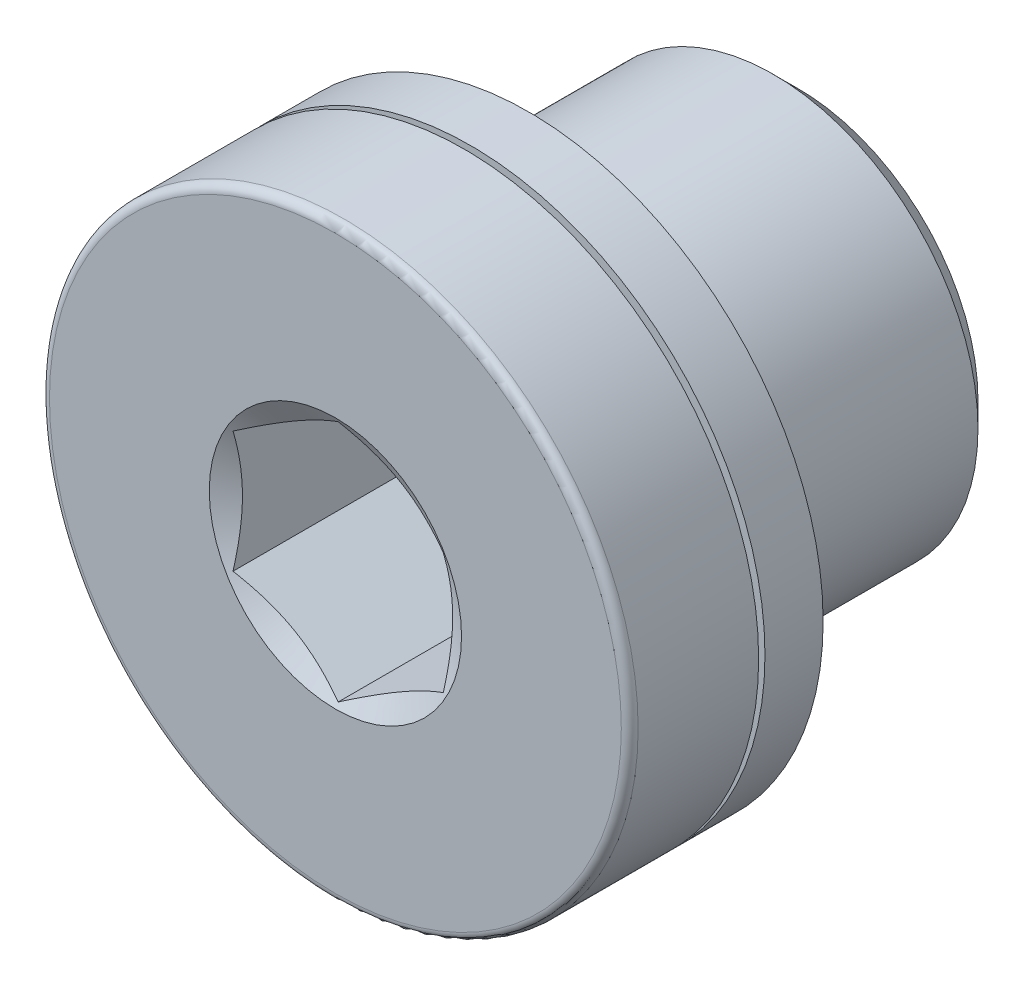
ISO-10303-21;
HEADER;
FILE_DESCRIPTION(('STEP AP214'),'2;1');
FILE_NAME('part.step','',(''),(''),'','','');
FILE_SCHEMA(('AUTOMOTIVE_DESIGN { 1 0 10303 214 1 1 1 1 }'));
ENDSEC;
DATA;
#1=APPLICATION_CONTEXT('core data for automotive mechanical design processes');
#2=APPLICATION_PROTOCOL_DEFINITION('international standard','automotive_design',2000,#1);
#3=PRODUCT_CONTEXT('',#1,'mechanical');
#4=PRODUCT('Part','Part','',(#3));
#5=PRODUCT_RELATED_PRODUCT_CATEGORY('part','',(#4));
#6=PRODUCT_DEFINITION_FORMATION('','',#4);
#7=PRODUCT_DEFINITION_CONTEXT('part definition',#1,'design');
#8=PRODUCT_DEFINITION('design','',#6,#7);
#9=PRODUCT_DEFINITION_SHAPE('','',#8);
#10=(LENGTH_UNIT() NAMED_UNIT(*) SI_UNIT(.MILLI.,.METRE.));
#11=(NAMED_UNIT(*) PLANE_ANGLE_UNIT() SI_UNIT($,.RADIAN.));
#12=(NAMED_UNIT(*) SI_UNIT($,.STERADIAN.) SOLID_ANGLE_UNIT());
#13=UNCERTAINTY_MEASURE_WITH_UNIT(LENGTH_MEASURE(1.E-05),#10,'distance_accuracy_value','');
#14=(GEOMETRIC_REPRESENTATION_CONTEXT(3) GLOBAL_UNCERTAINTY_ASSIGNED_CONTEXT((#13)) GLOBAL_UNIT_ASSIGNED_CONTEXT((#10,
#11,#12)) REPRESENTATION_CONTEXT('',''));
#15=CARTESIAN_POINT('',(0.,0.,0.));
#16=DIRECTION('',(0.,0.,1.));
#17=DIRECTION('',(1.,0.,0.));
#18=AXIS2_PLACEMENT_3D('',#15,#16,#17);
#19=CARTESIAN_POINT('',(0.,0.,4.6));
#20=DIRECTION('',(0.,0.,1.));
#21=DIRECTION('',(1.,0.,0.));
#22=AXIS2_PLACEMENT_3D('',#19,#20,#21);
#23=CONICAL_SURFACE('',#22,3.,1.04719755119659);
#24=CARTESIAN_POINT('',(0.0002,-2.88686681600194,4.53468252976428));
#25=CARTESIAN_POINT('',(-0.109663234734872,-2.82343724785372,4.4980464855128));
#26=CARTESIAN_POINT('',(-0.220474799896527,-2.75946016087832,4.46472708437023));
#27=CARTESIAN_POINT('',(-0.444016833466053,-2.63039810762176,4.40656715096303));
#28=CARTESIAN_POINT('',(-0.556751274528392,-2.56531084772748,4.38174719455291));
#29=CARTESIAN_POINT('',(-0.780822993875274,-2.43594298024478,4.34311051684623));
#30=CARTESIAN_POINT('',(-0.892125791767382,-2.37168227992022,4.32903666159082));
#31=CARTESIAN_POINT('',(-1.11525522746834,-2.24285844015414,4.31223401775793));
#32=CARTESIAN_POINT('',(-1.22708105401423,-2.17829576909552,4.30949131660881));
#33=CARTESIAN_POINT('',(-1.43604197555153,-2.05765212479586,4.31519062541324));
#34=CARTESIAN_POINT('',(-1.53320831755774,-2.00155311108241,4.32223325978705));
#35=CARTESIAN_POINT('',(-1.72690794971101,-1.88972057631679,4.34455628453013));
#36=CARTESIAN_POINT('',(-1.82344056965974,-1.83398744220381,4.35984430384546));
#37=CARTESIAN_POINT('',(-2.01753972174048,-1.72192424450052,4.39806395924961));
#38=CARTESIAN_POINT('',(-2.11508168178214,-1.66560836761319,4.42115764153071));
#39=CARTESIAN_POINT('',(-2.30871060807609,-1.55381665489449,4.47357152198311));
#40=CARTESIAN_POINT('',(-2.40480005588618,-1.49833938633505,4.50287940102974));
#41=CARTESIAN_POINT('',(-2.5002,-1.44326020292026,4.5346825297643));
#42=B_SPLINE_CURVE_WITH_KNOTS('',3,(#24,#25,#26,#27,#28,#29,#30,#31,#32,#33,#34,#35,#36,#37,#38,
#39,#40,#41),.UNSPECIFIED.,.F.,.F.,(4,2,2,2,2,2,2,2,4),(0.,0.396285827362224,0.793524330152046,
1.18093086852113,1.56786160134474,1.90479741793731,2.24204551660461,2.58677531536753,
2.93082800105253),.UNSPECIFIED.);
#43=CARTESIAN_POINT('',(0.,-2.8867513459481,4.53461585909777));
#44=VERTEX_POINT('',#43);
#45=CARTESIAN_POINT('',(-2.5,-1.4433756729741,4.5346158590978));
#46=VERTEX_POINT('',#45);
#47=EDGE_CURVE('E169',#44,#46,#42,.T.);
#48=ORIENTED_EDGE('',*,*,#47,.T.);
#49=CARTESIAN_POINT('',(-2.5,-3.75749145788339,5.47363157625222));
#50=CARTESIAN_POINT('',(-2.5,-3.64919841186996,5.42159269845017));
#51=CARTESIAN_POINT('',(-2.5,-3.54064339466357,5.37008890891806));
#52=CARTESIAN_POINT('',(-2.5,-3.3228694949907,5.26845533167727));
#53=CARTESIAN_POINT('',(-2.5,-3.21365049870229,5.21832578815435));
#54=CARTESIAN_POINT('',(-2.5,-2.99378661171534,5.11946624529765));
#55=CARTESIAN_POINT('',(-2.5,-2.88313709481265,5.07074649627705));
#56=CARTESIAN_POINT('',(-2.5,-2.66091438011002,4.97546923020821));
#57=CARTESIAN_POINT('',(-2.5,-2.54934123033597,4.9289116015586));
#58=CARTESIAN_POINT('',(-2.5,-2.32208129336724,4.83731979627917));
#59=CARTESIAN_POINT('',(-2.5,-2.20636439775533,4.79235988936502));
#60=CARTESIAN_POINT('',(-2.5,-1.97353370620353,4.70614167940336));
#61=CARTESIAN_POINT('',(-2.5,-1.85641974950128,4.66488380710281));
#62=CARTESIAN_POINT('',(-2.5,-1.62086916254349,4.5872406855576));
#63=CARTESIAN_POINT('',(-2.5,-1.50243619221283,4.55084445195485));
#64=CARTESIAN_POINT('',(-2.5,-1.26387801933199,4.48416968869073));
#65=CARTESIAN_POINT('',(-2.5,-1.14375340016755,4.45388910268924));
#66=CARTESIAN_POINT('',(-2.5,-0.902338315588339,4.40111657414383));
#67=CARTESIAN_POINT('',(-2.5,-0.781055515817549,4.37859024001396));
#68=CARTESIAN_POINT('',(-2.5,-0.537116621073338,4.3426935344368));
#69=CARTESIAN_POINT('',(-2.5,-0.414460624499676,4.32932251115766));
#70=CARTESIAN_POINT('',(-2.5,-0.169933632509077,4.31297766586888));
#71=CARTESIAN_POINT('',(-2.5,-0.0480711310514733,4.30987983675657));
#72=CARTESIAN_POINT('',(-2.5,0.195485912370085,4.31402426820572));
#73=CARTESIAN_POINT('',(-2.5,0.317180443894922,4.32126714481277));
#74=CARTESIAN_POINT('',(-2.5,0.527456408460873,4.34222611926243));
#75=CARTESIAN_POINT('',(-2.5,0.616270494320809,4.35371939209446));
#76=CARTESIAN_POINT('',(-2.5,0.793165661114637,4.38142947009885));
#77=CARTESIAN_POINT('',(-2.5,0.881246624045095,4.39764702112567));
#78=CARTESIAN_POINT('',(-2.5,1.14430390620604,4.45252703656414));
#79=CARTESIAN_POINT('',(-2.5,1.31798441198842,4.49740451996552));
#80=CARTESIAN_POINT('',(-2.5,1.66560393932168,4.60012958744614));
#81=CARTESIAN_POINT('',(-2.5,1.83945995346305,4.65824757701734));
#82=CARTESIAN_POINT('',(-2.5,2.09786165668661,4.75179017857617));
#83=CARTESIAN_POINT('',(-2.5,2.1835867516938,4.78402705771562));
#84=CARTESIAN_POINT('',(-2.5,2.35434488597652,4.85028226615287));
#85=CARTESIAN_POINT('',(-2.5,2.43937793702382,4.88430056507499));
#86=CARTESIAN_POINT('',(-2.5,2.65783078845747,4.97390856047049));
#87=CARTESIAN_POINT('',(-2.5,2.79079865565841,5.03059753836762));
#88=CARTESIAN_POINT('',(-2.5,3.05552029816646,5.14675125941288));
#89=CARTESIAN_POINT('',(-2.5,3.1872739810192,5.20621621188097));
#90=CARTESIAN_POINT('',(-2.5,3.44982928957636,5.32729059884971));
#91=CARTESIAN_POINT('',(-2.5,3.58063066968332,5.38890056440082));
#92=CARTESIAN_POINT('',(-2.5,3.84143730899347,5.5137857678841));
#93=CARTESIAN_POINT('',(-2.5,3.97144255002224,5.5770610436589));
#94=CARTESIAN_POINT('',(-2.5,4.36080606086041,5.76899660590649));
#95=CARTESIAN_POINT('',(-2.5,4.61919627366509,5.89961875475503));
#96=CARTESIAN_POINT('',(-2.5,5.13419069594109,6.16422182703926));
#97=CARTESIAN_POINT('',(-2.5,5.39079516582663,6.29820224704552));
#98=CARTESIAN_POINT('',(-2.5,5.87829290022415,6.55556666858143));
#99=CARTESIAN_POINT('',(-2.5,6.1092982352758,6.67873872928103));
#100=CARTESIAN_POINT('',(-2.5,6.57056638334677,6.92648759696893));
#101=CARTESIAN_POINT('',(-2.5,6.80082916311344,7.05106446577326));
#102=CARTESIAN_POINT('',(-2.5,7.26018235402638,7.30094373247041));
#103=CARTESIAN_POINT('',(-2.5,7.48927425655952,7.42624339179654));
#104=CARTESIAN_POINT('',(-2.5,7.94699348534722,7.67765659040072));
#105=CARTESIAN_POINT('',(-2.5,8.17562083840484,7.80377008086275));
#106=CARTESIAN_POINT('',(-2.5,8.40408211674829,7.9301817771395));
#107=B_SPLINE_CURVE_WITH_KNOTS('',3,(#49,#50,#51,#52,#53,#54,#55,#56,#57,#58,#59,#60,#61,#62,
#63,#64,#65,#66,#67,#68,#69,#70,#71,#72,#73,#74,#75,#76,#77,#78,#79,#80,#81,#82,#83,#84,#85,#86,
#87,#88,#89,#90,#91,#92,#93,#94,#95,#96,#97,#98,#99,#100,#101,#102,#103,#104,#105,#106),
.UNSPECIFIED.,.F.,.F.,(4,2,2,2,2,2,2,2,2,2,2,2,2,2,2,2,2,2,2,2,2,2,2,2,2,2,2,2,4),(0.,
0.360447630530675,0.720958898184671,1.08364194495586,1.44630625039165,1.81869010813538,
2.19111723824031,2.56268813752938,2.9341338901541,3.30391031762943,3.6736604153465,
4.03893071469015,4.40422277585142,4.67275529434614,4.94133023092329,5.47881127867105,
6.02844936287521,6.30319201919184,6.57792999229022,7.01152864941954,7.44516005465796,
7.87889959021416,8.31264899062128,9.18119380548513,10.0496091887469,10.8349772920855,
11.6203800900341,12.4037350961383,13.1870435431149),.UNSPECIFIED.);
#108=CARTESIAN_POINT('',(-2.5,1.4433756729741,4.5346158590978));
#109=VERTEX_POINT('',#108);
#110=EDGE_CURVE('E11',#46,#109,#107,.T.);
#111=ORIENTED_EDGE('',*,*,#110,.T.);
#112=CARTESIAN_POINT('',(-2.5002,1.44326020292026,4.5346825297643));
#113=CARTESIAN_POINT('',(-2.39033676526513,1.50668977106848,4.49804648551282));
#114=CARTESIAN_POINT('',(-2.27952520010347,1.57066685804388,4.46472708437025));
#115=CARTESIAN_POINT('',(-2.05598316653394,1.69972891130044,4.40656715096305));
#116=CARTESIAN_POINT('',(-1.9432487254716,1.76481617119472,4.38174719455293));
#117=CARTESIAN_POINT('',(-1.71917700612472,1.89418403867742,4.34311051684624));
#118=CARTESIAN_POINT('',(-1.60787420823261,1.95844473900199,4.32903666159083));
#119=CARTESIAN_POINT('',(-1.38474477253165,2.08726857876806,4.31223401775793));
#120=CARTESIAN_POINT('',(-1.27291894598575,2.15183124982668,4.30949131660881));
#121=CARTESIAN_POINT('',(-1.06395802444846,2.27247489412635,4.31519062541324));
#122=CARTESIAN_POINT('',(-0.966791682442249,2.3285739078398,4.32223325978704));
#123=CARTESIAN_POINT('',(-0.773092050288982,2.44040644260542,4.34455628453012));
#124=CARTESIAN_POINT('',(-0.676559430340254,2.49613957671839,4.35984430384545));
#125=CARTESIAN_POINT('',(-0.482460278259514,2.60820277442168,4.3980639592496));
#126=CARTESIAN_POINT('',(-0.384918318217852,2.66451865130901,4.42115764153069));
#127=CARTESIAN_POINT('',(-0.191289391923912,2.77631036402771,4.47357152198309));
#128=CARTESIAN_POINT('',(-0.0951999441138225,2.83178763258715,4.50287940102972));
#129=CARTESIAN_POINT('',(0.000199999999999802,2.88686681600194,4.53468252976428));
#130=B_SPLINE_CURVE_WITH_KNOTS('',3,(#112,#113,#114,#115,#116,#117,#118,#119,#120,#121,#122,
#123,#124,#125,#126,#127,#128,#129),.UNSPECIFIED.,.F.,.F.,(4,2,2,2,2,2,2,2,4),(0.,
0.39628582736223,0.793524330152058,1.18093086852115,1.56786160134477,1.90479741793733,
2.24204551660462,2.58677531536754,2.93082800105253),.UNSPECIFIED.);
#131=CARTESIAN_POINT('',(0.,2.8867513459481,4.53461585909777));
#132=VERTEX_POINT('',#131);
#133=EDGE_CURVE('E49',#109,#132,#130,.T.);
#134=ORIENTED_EDGE('',*,*,#133,.T.);
#135=CARTESIAN_POINT('',(-0.0002,2.88686681600194,4.53468252976428));
#136=CARTESIAN_POINT('',(0.109663234734872,2.82343724785372,4.4980464855128));
#137=CARTESIAN_POINT('',(0.220474799896527,2.75946016087832,4.46472708437023));
#138=CARTESIAN_POINT('',(0.444016833466053,2.63039810762176,4.40656715096303));
#139=CARTESIAN_POINT('',(0.556751274528392,2.56531084772748,4.38174719455291));
#140=CARTESIAN_POINT('',(0.780822993875274,2.43594298024478,4.34311051684623));
#141=CARTESIAN_POINT('',(0.892125791767382,2.37168227992022,4.32903666159082));
#142=CARTESIAN_POINT('',(1.11525522746834,2.24285844015414,4.31223401775793));
#143=CARTESIAN_POINT('',(1.22708105401423,2.17829576909552,4.30949131660881));
#144=CARTESIAN_POINT('',(1.43604197555153,2.05765212479586,4.31519062541324));
#145=CARTESIAN_POINT('',(1.53320831755774,2.00155311108241,4.32223325978705));
#146=CARTESIAN_POINT('',(1.72690794971101,1.88972057631679,4.34455628453013));
#147=CARTESIAN_POINT('',(1.82344056965974,1.83398744220381,4.35984430384546));
#148=CARTESIAN_POINT('',(2.01753972174048,1.72192424450052,4.39806395924961));
#149=CARTESIAN_POINT('',(2.11508168178214,1.66560836761319,4.42115764153071));
#150=CARTESIAN_POINT('',(2.30871060807609,1.55381665489449,4.47357152198311));
#151=CARTESIAN_POINT('',(2.40480005588618,1.49833938633505,4.50287940102974));
#152=CARTESIAN_POINT('',(2.5002,1.44326020292026,4.5346825297643));
#153=B_SPLINE_CURVE_WITH_KNOTS('',3,(#135,#136,#137,#138,#139,#140,#141,#142,#143,#144,#145,
#146,#147,#148,#149,#150,#151,#152),.UNSPECIFIED.,.F.,.F.,(4,2,2,2,2,2,2,2,4),(0.,
0.396285827362224,0.793524330152046,1.18093086852113,1.56786160134474,1.90479741793731,
2.24204551660461,2.58677531536753,2.93082800105253),.UNSPECIFIED.);
#154=CARTESIAN_POINT('',(2.5,1.4433756729741,4.5346158590978));
#155=VERTEX_POINT('',#154);
#156=EDGE_CURVE('E279',#132,#155,#153,.T.);
#157=ORIENTED_EDGE('',*,*,#156,.T.);
#158=CARTESIAN_POINT('',(2.5,-3.75749145788339,5.47363157625222));
#159=CARTESIAN_POINT('',(2.5,-3.64919841186996,5.42159269845017));
#160=CARTESIAN_POINT('',(2.5,-3.54064339466357,5.37008890891806));
#161=CARTESIAN_POINT('',(2.5,-3.3228694949907,5.26845533167727));
#162=CARTESIAN_POINT('',(2.5,-3.21365049870229,5.21832578815435));
#163=CARTESIAN_POINT('',(2.5,-2.99378661171534,5.11946624529765));
#164=CARTESIAN_POINT('',(2.5,-2.88313709481265,5.07074649627705));
#165=CARTESIAN_POINT('',(2.5,-2.66091438011002,4.97546923020821));
#166=CARTESIAN_POINT('',(2.5,-2.54934123033597,4.9289116015586));
#167=CARTESIAN_POINT('',(2.5,-2.32208129336724,4.83731979627917));
#168=CARTESIAN_POINT('',(2.5,-2.20636439775533,4.79235988936502));
#169=CARTESIAN_POINT('',(2.5,-1.97353370620353,4.70614167940336));
#170=CARTESIAN_POINT('',(2.5,-1.85641974950128,4.66488380710281));
#171=CARTESIAN_POINT('',(2.5,-1.62086916254349,4.5872406855576));
#172=CARTESIAN_POINT('',(2.5,-1.50243619221283,4.55084445195485));
#173=CARTESIAN_POINT('',(2.5,-1.26387801933199,4.48416968869073));
#174=CARTESIAN_POINT('',(2.5,-1.14375340016755,4.45388910268924));
#175=CARTESIAN_POINT('',(2.5,-0.902338315588339,4.40111657414383));
#176=CARTESIAN_POINT('',(2.5,-0.781055515817549,4.37859024001396));
#177=CARTESIAN_POINT('',(2.5,-0.537116621073338,4.3426935344368));
#178=CARTESIAN_POINT('',(2.5,-0.414460624499676,4.32932251115766));
#179=CARTESIAN_POINT('',(2.5,-0.169933632509077,4.31297766586888));
#180=CARTESIAN_POINT('',(2.5,-0.0480711310514733,4.30987983675657));
#181=CARTESIAN_POINT('',(2.5,0.195485912370085,4.31402426820572));
#182=CARTESIAN_POINT('',(2.5,0.317180443894922,4.32126714481277));
#183=CARTESIAN_POINT('',(2.5,0.527456408460873,4.34222611926243));
#184=CARTESIAN_POINT('',(2.5,0.616270494320809,4.35371939209446));
#185=CARTESIAN_POINT('',(2.5,0.793165661114637,4.38142947009885));
#186=CARTESIAN_POINT('',(2.5,0.881246624045095,4.39764702112567));
#187=CARTESIAN_POINT('',(2.5,1.14430390620604,4.45252703656414));
#188=CARTESIAN_POINT('',(2.5,1.31798441198842,4.49740451996552));
#189=CARTESIAN_POINT('',(2.5,1.66560393932168,4.60012958744614));
#190=CARTESIAN_POINT('',(2.5,1.83945995346305,4.65824757701734));
#191=CARTESIAN_POINT('',(2.5,2.09786165668661,4.75179017857617));
#192=CARTESIAN_POINT('',(2.5,2.1835867516938,4.78402705771562));
#193=CARTESIAN_POINT('',(2.5,2.35434488597652,4.85028226615287));
#194=CARTESIAN_POINT('',(2.5,2.43937793702382,4.88430056507499));
#195=CARTESIAN_POINT('',(2.5,2.65783078845747,4.97390856047049));
#196=CARTESIAN_POINT('',(2.5,2.79079865565841,5.03059753836762));
#197=CARTESIAN_POINT('',(2.5,3.05552029816646,5.14675125941288));
#198=CARTESIAN_POINT('',(2.5,3.1872739810192,5.20621621188097));
#199=CARTESIAN_POINT('',(2.5,3.44982928957636,5.32729059884971));
#200=CARTESIAN_POINT('',(2.5,3.58063066968332,5.38890056440082));
#201=CARTESIAN_POINT('',(2.5,3.84143730899347,5.5137857678841));
#202=CARTESIAN_POINT('',(2.5,3.97144255002224,5.5770610436589));
#203=CARTESIAN_POINT('',(2.5,4.36080606086041,5.76899660590649));
#204=CARTESIAN_POINT('',(2.5,4.61919627366509,5.89961875475503));
#205=CARTESIAN_POINT('',(2.5,5.13419069594109,6.16422182703926));
#206=CARTESIAN_POINT('',(2.5,5.39079516582663,6.29820224704552));
#207=CARTESIAN_POINT('',(2.5,5.87829290022415,6.55556666858143));
#208=CARTESIAN_POINT('',(2.5,6.1092982352758,6.67873872928103));
#209=CARTESIAN_POINT('',(2.5,6.57056638334677,6.92648759696893));
#210=CARTESIAN_POINT('',(2.5,6.80082916311344,7.05106446577326));
#211=CARTESIAN_POINT('',(2.5,7.26018235402638,7.30094373247041));
#212=CARTESIAN_POINT('',(2.5,7.48927425655952,7.42624339179654));
#213=CARTESIAN_POINT('',(2.5,7.94699348534722,7.67765659040072));
#214=CARTESIAN_POINT('',(2.5,8.17562083840484,7.80377008086275));
#215=CARTESIAN_POINT('',(2.5,8.40408211674829,7.9301817771395));
#216=B_SPLINE_CURVE_WITH_KNOTS('',3,(#158,#159,#160,#161,#162,#163,#164,#165,#166,#167,#168,
#169,#170,#171,#172,#173,#174,#175,#176,#177,#178,#179,#180,#181,#182,#183,#184,#185,#186,#187,
#188,#189,#190,#191,#192,#193,#194,#195,#196,#197,#198,#199,#200,#201,#202,#203,#204,#205,#206,
#207,#208,#209,#210,#211,#212,#213,#214,#215),.UNSPECIFIED.,.F.,.F.,(4,2,2,2,2,2,2,2,2,2,2,2,2,
2,2,2,2,2,2,2,2,2,2,2,2,2,2,2,4),(0.,0.360447630530675,0.720958898184671,1.08364194495586,
1.44630625039165,1.81869010813538,2.19111723824031,2.56268813752938,2.9341338901541,
3.30391031762943,3.6736604153465,4.03893071469015,4.40422277585142,4.67275529434614,
4.94133023092329,5.47881127867105,6.02844936287521,6.30319201919184,6.57792999229022,
7.01152864941954,7.44516005465796,7.87889959021416,8.31264899062128,9.18119380548513,
10.0496091887469,10.8349772920855,11.6203800900341,12.4037350961383,13.1870435431149),.UNSPECIFIED.);
#217=CARTESIAN_POINT('',(2.5,-1.4433756729741,4.5346158590978));
#218=VERTEX_POINT('',#217);
#219=EDGE_CURVE('E275',#155,#218,#216,.F.);
#220=ORIENTED_EDGE('',*,*,#219,.T.);
#221=CARTESIAN_POINT('',(2.5002,-1.44326020292026,4.5346825297643));
#222=CARTESIAN_POINT('',(2.39033676526513,-1.50668977106848,4.49804648551282));
#223=CARTESIAN_POINT('',(2.27952520010347,-1.57066685804388,4.46472708437025));
#224=CARTESIAN_POINT('',(2.05598316653394,-1.69972891130044,4.40656715096305));
#225=CARTESIAN_POINT('',(1.9432487254716,-1.76481617119472,4.38174719455293));
#226=CARTESIAN_POINT('',(1.71917700612472,-1.89418403867742,4.34311051684624));
#227=CARTESIAN_POINT('',(1.60787420823261,-1.95844473900199,4.32903666159083));
#228=CARTESIAN_POINT('',(1.38474477253165,-2.08726857876806,4.31223401775793));
#229=CARTESIAN_POINT('',(1.27291894598575,-2.15183124982668,4.30949131660881));
#230=CARTESIAN_POINT('',(1.06395802444846,-2.27247489412635,4.31519062541324));
#231=CARTESIAN_POINT('',(0.966791682442249,-2.3285739078398,4.32223325978704));
#232=CARTESIAN_POINT('',(0.773092050288982,-2.44040644260542,4.34455628453012));
#233=CARTESIAN_POINT('',(0.676559430340254,-2.49613957671839,4.35984430384545));
#234=CARTESIAN_POINT('',(0.482460278259514,-2.60820277442168,4.3980639592496));
#235=CARTESIAN_POINT('',(0.384918318217852,-2.66451865130901,4.42115764153069));
#236=CARTESIAN_POINT('',(0.191289391923912,-2.77631036402771,4.47357152198309));
#237=CARTESIAN_POINT('',(0.0951999441138225,-2.83178763258715,4.50287940102972));
#238=CARTESIAN_POINT('',(-0.000199999999999802,-2.88686681600194,4.53468252976428));
#239=B_SPLINE_CURVE_WITH_KNOTS('',3,(#221,#222,#223,#224,#225,#226,#227,#228,#229,#230,#231,
#232,#233,#234,#235,#236,#237,#238),.UNSPECIFIED.,.F.,.F.,(4,2,2,2,2,2,2,2,4),(0.,
0.39628582736223,0.793524330152058,1.18093086852115,1.56786160134477,1.90479741793733,
2.24204551660462,2.58677531536754,2.93082800105253),.UNSPECIFIED.);
#240=EDGE_CURVE('E176',#218,#44,#239,.T.);
#241=ORIENTED_EDGE('',*,*,#240,.T.);
#242=EDGE_LOOP('',(#48,#111,#134,#157,#220,#241));
#243=FACE_BOUND('',#242,.T.);
#244=CARTESIAN_POINT('',(0.,0.,4.6));
#245=DIRECTION('',(0.,0.,1.));
#246=DIRECTION('',(1.,0.,0.));
#247=AXIS2_PLACEMENT_3D('',#244,#245,#246);
#248=CIRCLE('',#247,3.);
#249=CARTESIAN_POINT('',(3.,0.,4.6));
#250=VERTEX_POINT('',#249);
#251=EDGE_CURVE('E166',#250,#250,#248,.T.);
#252=ORIENTED_EDGE('',*,*,#251,.T.);
#253=EDGE_LOOP('',(#252));
#254=FACE_BOUND('',#253,.T.);
#255=ADVANCED_FACE('F36',(#243,#254),#23,.F.);
#256=CARTESIAN_POINT('',(0.,3.,4.6));
#257=DIRECTION('',(0.,0.,-1.));
#258=DIRECTION('',(-1.,0.,0.));
#259=AXIS2_PLACEMENT_3D('',#256,#257,#258);
#260=PLANE('',#259);
#261=ORIENTED_EDGE('',*,*,#251,.F.);
#262=EDGE_LOOP('',(#261));
#263=FACE_BOUND('',#262,.T.);
#264=CARTESIAN_POINT('',(0.,0.,4.6));
#265=DIRECTION('',(0.,0.,1.));
#266=DIRECTION('',(1.,0.,0.));
#267=AXIS2_PLACEMENT_3D('',#264,#265,#266);
#268=CIRCLE('',#267,6.8);
#269=CARTESIAN_POINT('',(6.8,0.,4.6));
#270=VERTEX_POINT('',#269);
#271=EDGE_CURVE('E163',#270,#270,#268,.T.);
#272=ORIENTED_EDGE('',*,*,#271,.T.);
#273=EDGE_LOOP('',(#272));
#274=FACE_BOUND('',#273,.T.);
#275=ADVANCED_FACE('F234',(#263,#274),#260,.F.);
#276=CARTESIAN_POINT('',(0.,0.,4.39999999999997));
#277=DIRECTION('',(0.,0.,1.));
#278=DIRECTION('',(1.,0.,0.));
#279=AXIS2_PLACEMENT_3D('',#276,#277,#278);
#280=TOROIDAL_SURFACE('',#279,6.79999999999997,0.200000000000031);
#281=ORIENTED_EDGE('',*,*,#271,.F.);
#282=EDGE_LOOP('',(#281));
#283=FACE_BOUND('',#282,.T.);
#284=CARTESIAN_POINT('',(0.,0.,4.4));
#285=DIRECTION('',(0.,0.,1.));
#286=DIRECTION('',(1.,0.,0.));
#287=AXIS2_PLACEMENT_3D('',#284,#285,#286);
#288=CIRCLE('',#287,7.);
#289=CARTESIAN_POINT('',(7.,0.,4.4));
#290=VERTEX_POINT('',#289);
#291=EDGE_CURVE('E160',#290,#290,#288,.T.);
#292=ORIENTED_EDGE('',*,*,#291,.T.);
#293=EDGE_LOOP('',(#292));
#294=FACE_BOUND('',#293,.T.);
#295=ADVANCED_FACE('F231',(#283,#294),#280,.T.);
#296=CARTESIAN_POINT('',(0.,0.,-6.4));
#297=DIRECTION('',(0.,0.,1.));
#298=DIRECTION('',(1.,0.,0.));
#299=AXIS2_PLACEMENT_3D('',#296,#297,#298);
#300=CYLINDRICAL_SURFACE('',#299,7.);
#301=ORIENTED_EDGE('',*,*,#291,.F.);
#302=EDGE_LOOP('',(#301));
#303=FACE_BOUND('',#302,.T.);
#304=CARTESIAN_POINT('',(0.,0.,1.5333333333333));
#305=DIRECTION('',(0.,0.,1.));
#306=DIRECTION('',(1.,0.,0.));
#307=AXIS2_PLACEMENT_3D('',#304,#305,#306);
#308=CIRCLE('',#307,7.);
#309=CARTESIAN_POINT('',(7.,0.,1.5333333333333));
#310=VERTEX_POINT('',#309);
#311=EDGE_CURVE('E157',#310,#310,#308,.T.);
#312=ORIENTED_EDGE('',*,*,#311,.T.);
#313=EDGE_LOOP('',(#312));
#314=FACE_BOUND('',#313,.T.);
#315=ADVANCED_FACE('F227',(#303,#314),#300,.T.);
#316=CARTESIAN_POINT('',(0.,7.,1.5333333333333));
#317=DIRECTION('',(0.,0.,1.));
#318=DIRECTION('',(1.,0.,0.));
#319=AXIS2_PLACEMENT_3D('',#316,#317,#318);
#320=PLANE('',#319);
#321=ORIENTED_EDGE('',*,*,#311,.F.);
#322=EDGE_LOOP('',(#321));
#323=FACE_BOUND('',#322,.T.);
#324=CARTESIAN_POINT('',(0.,0.,1.5333333333333));
#325=DIRECTION('',(0.,0.,1.));
#326=DIRECTION('',(1.,0.,0.));
#327=AXIS2_PLACEMENT_3D('',#324,#325,#326);
#328=CIRCLE('',#327,6.3);
#329=CARTESIAN_POINT('',(6.3,0.,1.5333333333333));
#330=VERTEX_POINT('',#329);
#331=EDGE_CURVE('E154',#330,#330,#328,.T.);
#332=ORIENTED_EDGE('',*,*,#331,.T.);
#333=EDGE_LOOP('',(#332));
#334=FACE_BOUND('',#333,.T.);
#335=ADVANCED_FACE('F223',(#323,#334),#320,.F.);
#336=CARTESIAN_POINT('',(0.,0.,-6.4));
#337=DIRECTION('',(0.,0.,1.));
#338=DIRECTION('',(1.,0.,0.));
#339=AXIS2_PLACEMENT_3D('',#336,#337,#338);
#340=CYLINDRICAL_SURFACE('',#339,6.3);
#341=ORIENTED_EDGE('',*,*,#331,.F.);
#342=EDGE_LOOP('',(#341));
#343=FACE_BOUND('',#342,.T.);
#344=CARTESIAN_POINT('',(0.,0.,1.3833333333333));
#345=DIRECTION('',(0.,0.,1.));
#346=DIRECTION('',(1.,0.,0.));
#347=AXIS2_PLACEMENT_3D('',#344,#345,#346);
#348=CIRCLE('',#347,6.3);
#349=CARTESIAN_POINT('',(6.3,0.,1.3833333333333));
#350=VERTEX_POINT('',#349);
#351=EDGE_CURVE('E151',#350,#350,#348,.T.);
#352=ORIENTED_EDGE('',*,*,#351,.T.);
#353=EDGE_LOOP('',(#352));
#354=FACE_BOUND('',#353,.T.);
#355=ADVANCED_FACE('F219',(#343,#354),#340,.T.);
#356=CARTESIAN_POINT('',(0.,6.3,1.3833333333333));
#357=DIRECTION('',(0.,0.,-1.));
#358=DIRECTION('',(-1.,0.,0.));
#359=AXIS2_PLACEMENT_3D('',#356,#357,#358);
#360=PLANE('',#359);
#361=ORIENTED_EDGE('',*,*,#351,.F.);
#362=EDGE_LOOP('',(#361));
#363=FACE_BOUND('',#362,.T.);
#364=CARTESIAN_POINT('',(0.,0.,1.3833333333333));
#365=DIRECTION('',(0.,0.,1.));
#366=DIRECTION('',(1.,0.,0.));
#367=AXIS2_PLACEMENT_3D('',#364,#365,#366);
#368=CIRCLE('',#367,7.);
#369=CARTESIAN_POINT('',(7.,0.,1.3833333333333));
#370=VERTEX_POINT('',#369);
#371=EDGE_CURVE('E148',#370,#370,#368,.T.);
#372=ORIENTED_EDGE('',*,*,#371,.T.);
#373=EDGE_LOOP('',(#372));
#374=FACE_BOUND('',#373,.T.);
#375=ADVANCED_FACE('F215',(#363,#374),#360,.F.);
#376=CARTESIAN_POINT('',(0.,0.,-6.4));
#377=DIRECTION('',(0.,0.,1.));
#378=DIRECTION('',(1.,0.,0.));
#379=AXIS2_PLACEMENT_3D('',#376,#377,#378);
#380=CYLINDRICAL_SURFACE('',#379,7.);
#381=ORIENTED_EDGE('',*,*,#371,.F.);
#382=EDGE_LOOP('',(#381));
#383=FACE_BOUND('',#382,.T.);
#384=CARTESIAN_POINT('',(0.,0.,0.));
#385=DIRECTION('',(0.,0.,1.));
#386=DIRECTION('',(1.,0.,0.));
#387=AXIS2_PLACEMENT_3D('',#384,#385,#386);
#388=CIRCLE('',#387,7.);
#389=CARTESIAN_POINT('',(7.,0.,0.));
#390=VERTEX_POINT('',#389);
#391=EDGE_CURVE('E145',#390,#390,#388,.T.);
#392=ORIENTED_EDGE('',*,*,#391,.T.);
#393=EDGE_LOOP('',(#392));
#394=FACE_BOUND('',#393,.T.);
#395=ADVANCED_FACE('F211',(#383,#394),#380,.T.);
#396=CARTESIAN_POINT('',(0.,7.,0.));
#397=DIRECTION('',(0.,0.,1.));
#398=DIRECTION('',(1.,0.,0.));
#399=AXIS2_PLACEMENT_3D('',#396,#397,#398);
#400=PLANE('',#399);
#401=ORIENTED_EDGE('',*,*,#391,.F.);
#402=EDGE_LOOP('',(#401));
#403=FACE_BOUND('',#402,.T.);
#404=CARTESIAN_POINT('',(0.,0.,0.));
#405=DIRECTION('',(0.,0.,1.));
#406=DIRECTION('',(1.,0.,0.));
#407=AXIS2_PLACEMENT_3D('',#404,#405,#406);
#408=CIRCLE('',#407,4.283);
#409=CARTESIAN_POINT('',(4.283,0.,0.));
#410=VERTEX_POINT('',#409);
#411=EDGE_CURVE('E142',#410,#410,#408,.T.);
#412=ORIENTED_EDGE('',*,*,#411,.T.);
#413=EDGE_LOOP('',(#412));
#414=FACE_BOUND('',#413,.T.);
#415=ADVANCED_FACE('F207',(#403,#414),#400,.F.);
#416=CARTESIAN_POINT('',(0.,0.,-0.581));
#417=DIRECTION('',(0.,0.,-1.));
#418=DIRECTION('',(-1.,0.,0.));
#419=AXIS2_PLACEMENT_3D('',#416,#417,#418);
#420=CONICAL_SURFACE('',#419,4.864,0.785398163397448);
#421=ORIENTED_EDGE('',*,*,#411,.F.);
#422=EDGE_LOOP('',(#421));
#423=FACE_BOUND('',#422,.T.);
#424=CARTESIAN_POINT('',(0.,0.,-0.581));
#425=DIRECTION('',(0.,0.,1.));
#426=DIRECTION('',(1.,0.,0.));
#427=AXIS2_PLACEMENT_3D('',#424,#425,#426);
#428=CIRCLE('',#427,4.864);
#429=CARTESIAN_POINT('',(4.864,0.,-0.581));
#430=VERTEX_POINT('',#429);
#431=EDGE_CURVE('E139',#430,#430,#428,.T.);
#432=ORIENTED_EDGE('',*,*,#431,.T.);
#433=EDGE_LOOP('',(#432));
#434=FACE_BOUND('',#433,.T.);
#435=ADVANCED_FACE('F203',(#423,#434),#420,.T.);
#436=CARTESIAN_POINT('',(0.,0.,-6.4));
#437=DIRECTION('',(0.,0.,1.));
#438=DIRECTION('',(1.,0.,0.));
#439=AXIS2_PLACEMENT_3D('',#436,#437,#438);
#440=CYLINDRICAL_SURFACE('',#439,4.864);
#441=ORIENTED_EDGE('',*,*,#431,.F.);
#442=EDGE_LOOP('',(#441));
#443=FACE_BOUND('',#442,.T.);
#444=CARTESIAN_POINT('',(0.,0.,-5.819));
#445=DIRECTION('',(0.,0.,1.));
#446=DIRECTION('',(1.,0.,0.));
#447=AXIS2_PLACEMENT_3D('',#444,#445,#446);
#448=CIRCLE('',#447,4.864);
#449=CARTESIAN_POINT('',(4.864,0.,-5.819));
#450=VERTEX_POINT('',#449);
#451=EDGE_CURVE('E136',#450,#450,#448,.T.);
#452=ORIENTED_EDGE('',*,*,#451,.T.);
#453=EDGE_LOOP('',(#452));
#454=FACE_BOUND('',#453,.T.);
#455=ADVANCED_FACE('F199',(#443,#454),#440,.T.);
#456=CARTESIAN_POINT('',(0.,0.,-6.4));
#457=DIRECTION('',(0.,0.,1.));
#458=DIRECTION('',(1.,0.,0.));
#459=AXIS2_PLACEMENT_3D('',#456,#457,#458);
#460=CONICAL_SURFACE('',#459,4.283,0.785398163397448);
#461=ORIENTED_EDGE('',*,*,#451,.F.);
#462=EDGE_LOOP('',(#461));
#463=FACE_BOUND('',#462,.T.);
#464=CARTESIAN_POINT('',(0.,0.,-6.4));
#465=DIRECTION('',(0.,0.,1.));
#466=DIRECTION('',(1.,0.,0.));
#467=AXIS2_PLACEMENT_3D('',#464,#465,#466);
#468=CIRCLE('',#467,4.283);
#469=CARTESIAN_POINT('',(4.283,0.,-6.4));
#470=VERTEX_POINT('',#469);
#471=EDGE_CURVE('E124',#470,#470,#468,.T.);
#472=ORIENTED_EDGE('',*,*,#471,.T.);
#473=EDGE_LOOP('',(#472));
#474=FACE_BOUND('',#473,.T.);
#475=ADVANCED_FACE('F195',(#463,#474),#460,.T.);
#476=CARTESIAN_POINT('',(0.,4.283,-6.4));
#477=DIRECTION('',(0.,0.,1.));
#478=DIRECTION('',(1.,0.,0.));
#479=AXIS2_PLACEMENT_3D('',#476,#477,#478);
#480=PLANE('',#479);
#481=ORIENTED_EDGE('',*,*,#471,.F.);
#482=EDGE_LOOP('',(#481));
#483=FACE_BOUND('',#482,.T.);
#484=ADVANCED_FACE('F192',(#483),#480,.F.);
#485=CARTESIAN_POINT('',(-2.5,1.4433756729741,0.));
#486=DIRECTION('',(-1.,0.,0.));
#487=DIRECTION('',(0.,0.,1.));
#488=AXIS2_PLACEMENT_3D('',#485,#486,#487);
#489=PLANE('',#488);
#490=DIRECTION('',(0.,0.,1.));
#491=VECTOR('',#490,1.);
#492=CARTESIAN_POINT('',(-2.5,-1.4433756729741,0.));
#493=LINE('',#492,#491);
#494=CARTESIAN_POINT('',(-2.5,-1.4433756729741,0.));
#495=VERTEX_POINT('',#494);
#496=EDGE_CURVE('E56',#495,#46,#493,.T.);
#497=ORIENTED_EDGE('',*,*,#496,.F.);
#498=DIRECTION('',(0.,-1.,0.));
#499=VECTOR('',#498,1.);
#500=CARTESIAN_POINT('',(-2.5,1.4433756729741,0.));
#501=LINE('',#500,#499);
#502=CARTESIAN_POINT('',(-2.5,1.4433756729741,0.));
#503=VERTEX_POINT('',#502);
#504=EDGE_CURVE('E95',#503,#495,#501,.T.);
#505=ORIENTED_EDGE('',*,*,#504,.F.);
#506=DIRECTION('',(0.,0.,1.));
#507=VECTOR('',#506,1.);
#508=CARTESIAN_POINT('',(-2.5,1.4433756729741,0.));
#509=LINE('',#508,#507);
#510=EDGE_CURVE('E122',#503,#109,#509,.T.);
#511=ORIENTED_EDGE('',*,*,#510,.T.);
#512=ORIENTED_EDGE('',*,*,#110,.F.);
#513=EDGE_LOOP('',(#497,#505,#511,#512));
#514=FACE_BOUND('',#513,.T.);
#515=ADVANCED_FACE('F93',(#514),#489,.F.);
#516=CARTESIAN_POINT('',(0.,2.8867513459481,0.));
#517=DIRECTION('',(-0.499999999999983,0.866025403784448,0.));
#518=DIRECTION('',(-0.866025403784448,-0.499999999999983,0.));
#519=AXIS2_PLACEMENT_3D('',#516,#517,#518);
#520=PLANE('',#519);
#521=ORIENTED_EDGE('',*,*,#510,.F.);
#522=DIRECTION('',(-0.866025403784448,-0.499999999999983,0.));
#523=VECTOR('',#522,1.);
#524=CARTESIAN_POINT('',(0.,2.8867513459481,0.));
#525=LINE('',#524,#523);
#526=CARTESIAN_POINT('',(0.,2.8867513459481,0.));
#527=VERTEX_POINT('',#526);
#528=EDGE_CURVE('E99',#527,#503,#525,.T.);
#529=ORIENTED_EDGE('',*,*,#528,.F.);
#530=DIRECTION('',(0.,0.,1.));
#531=VECTOR('',#530,1.);
#532=CARTESIAN_POINT('',(0.,2.8867513459481,0.));
#533=LINE('',#532,#531);
#534=EDGE_CURVE('E125',#527,#132,#533,.T.);
#535=ORIENTED_EDGE('',*,*,#534,.T.);
#536=ORIENTED_EDGE('',*,*,#133,.F.);
#537=EDGE_LOOP('',(#521,#529,#535,#536));
#538=FACE_BOUND('',#537,.T.);
#539=ADVANCED_FACE('F191',(#538),#520,.F.);
#540=CARTESIAN_POINT('',(2.5,1.4433756729741,0.));
#541=DIRECTION('',(0.499999999999983,0.866025403784448,0.));
#542=DIRECTION('',(-0.866025403784448,0.499999999999983,0.));
#543=AXIS2_PLACEMENT_3D('',#540,#541,#542);
#544=PLANE('',#543);
#545=ORIENTED_EDGE('',*,*,#534,.F.);
#546=DIRECTION('',(-0.866025403784448,0.499999999999983,0.));
#547=VECTOR('',#546,1.);
#548=CARTESIAN_POINT('',(2.5,1.4433756729741,0.));
#549=LINE('',#548,#547);
#550=CARTESIAN_POINT('',(2.5,1.4433756729741,0.));
#551=VERTEX_POINT('',#550);
#552=EDGE_CURVE('E119',#551,#527,#549,.T.);
#553=ORIENTED_EDGE('',*,*,#552,.F.);
#554=DIRECTION('',(0.,0.,1.));
#555=VECTOR('',#554,1.);
#556=CARTESIAN_POINT('',(2.5,1.4433756729741,0.));
#557=LINE('',#556,#555);
#558=EDGE_CURVE('E127',#551,#155,#557,.T.);
#559=ORIENTED_EDGE('',*,*,#558,.T.);
#560=ORIENTED_EDGE('',*,*,#156,.F.);
#561=EDGE_LOOP('',(#545,#553,#559,#560));
#562=FACE_BOUND('',#561,.T.);
#563=ADVANCED_FACE('F278',(#562),#544,.F.);
#564=CARTESIAN_POINT('',(2.5,-1.4433756729741,0.));
#565=DIRECTION('',(1.,0.,0.));
#566=DIRECTION('',(0.,0.,-1.));
#567=AXIS2_PLACEMENT_3D('',#564,#565,#566);
#568=PLANE('',#567);
#569=ORIENTED_EDGE('',*,*,#558,.F.);
#570=DIRECTION('',(0.,1.,0.));
#571=VECTOR('',#570,1.);
#572=CARTESIAN_POINT('',(2.5,-1.4433756729741,0.));
#573=LINE('',#572,#571);
#574=CARTESIAN_POINT('',(2.5,-1.4433756729741,0.));
#575=VERTEX_POINT('',#574);
#576=EDGE_CURVE('E116',#575,#551,#573,.T.);
#577=ORIENTED_EDGE('',*,*,#576,.F.);
#578=DIRECTION('',(0.,0.,1.));
#579=VECTOR('',#578,1.);
#580=CARTESIAN_POINT('',(2.5,-1.4433756729741,0.));
#581=LINE('',#580,#579);
#582=EDGE_CURVE('E130',#575,#218,#581,.T.);
#583=ORIENTED_EDGE('',*,*,#582,.T.);
#584=ORIENTED_EDGE('',*,*,#219,.F.);
#585=EDGE_LOOP('',(#569,#577,#583,#584));
#586=FACE_BOUND('',#585,.T.);
#587=ADVANCED_FACE('F274',(#586),#568,.F.);
#588=CARTESIAN_POINT('',(0.,-2.8867513459481,0.));
#589=DIRECTION('',(0.499999999999983,-0.866025403784448,0.));
#590=DIRECTION('',(0.866025403784448,0.499999999999983,0.));
#591=AXIS2_PLACEMENT_3D('',#588,#589,#590);
#592=PLANE('',#591);
#593=ORIENTED_EDGE('',*,*,#582,.F.);
#594=DIRECTION('',(0.866025403784448,0.499999999999983,0.));
#595=VECTOR('',#594,1.);
#596=CARTESIAN_POINT('',(0.,-2.8867513459481,0.));
#597=LINE('',#596,#595);
#598=CARTESIAN_POINT('',(0.,-2.8867513459481,0.));
#599=VERTEX_POINT('',#598);
#600=EDGE_CURVE('E108',#599,#575,#597,.T.);
#601=ORIENTED_EDGE('',*,*,#600,.F.);
#602=DIRECTION('',(0.,0.,1.));
#603=VECTOR('',#602,1.);
#604=CARTESIAN_POINT('',(0.,-2.8867513459481,0.));
#605=LINE('',#604,#603);
#606=EDGE_CURVE('E98',#599,#44,#605,.T.);
#607=ORIENTED_EDGE('',*,*,#606,.T.);
#608=ORIENTED_EDGE('',*,*,#240,.F.);
#609=EDGE_LOOP('',(#593,#601,#607,#608));
#610=FACE_BOUND('',#609,.T.);
#611=ADVANCED_FACE('F185',(#610),#592,.F.);
#612=CARTESIAN_POINT('',(-2.5,-1.4433756729741,0.));
#613=DIRECTION('',(-0.499999999999983,-0.866025403784448,0.));
#614=DIRECTION('',(0.866025403784448,-0.499999999999983,0.));
#615=AXIS2_PLACEMENT_3D('',#612,#613,#614);
#616=PLANE('',#615);
#617=ORIENTED_EDGE('',*,*,#606,.F.);
#618=DIRECTION('',(0.866025403784448,-0.499999999999983,0.));
#619=VECTOR('',#618,1.);
#620=CARTESIAN_POINT('',(-2.5,-1.4433756729741,0.));
#621=LINE('',#620,#619);
#622=EDGE_CURVE('E102',#495,#599,#621,.T.);
#623=ORIENTED_EDGE('',*,*,#622,.F.);
#624=ORIENTED_EDGE('',*,*,#496,.T.);
#625=ORIENTED_EDGE('',*,*,#47,.F.);
#626=EDGE_LOOP('',(#617,#623,#624,#625));
#627=FACE_BOUND('',#626,.T.);
#628=ADVANCED_FACE('F103',(#627),#616,.F.);
#629=CARTESIAN_POINT('',(0.,0.,0.));
#630=DIRECTION('',(0.,0.,1.));
#631=DIRECTION('',(1.,0.,0.));
#632=AXIS2_PLACEMENT_3D('',#629,#630,#631);
#633=PLANE('',#632);
#634=ORIENTED_EDGE('',*,*,#504,.T.);
#635=ORIENTED_EDGE('',*,*,#622,.T.);
#636=ORIENTED_EDGE('',*,*,#600,.T.);
#637=ORIENTED_EDGE('',*,*,#576,.T.);
#638=ORIENTED_EDGE('',*,*,#552,.T.);
#639=ORIENTED_EDGE('',*,*,#528,.T.);
#640=EDGE_LOOP('',(#634,#635,#636,#637,#638,#639));
#641=FACE_BOUND('',#640,.T.);
#642=ADVANCED_FACE('F110',(#641),#633,.T.);
#643=CLOSED_SHELL('',(#255,#275,#295,#315,#335,#355,#375,#395,#415,#435,#455,#475,#484,#515,
#539,#563,#587,#611,#628,#642));
#644=MANIFOLD_SOLID_BREP('B2',#643);
#645=ADVANCED_BREP_SHAPE_REPRESENTATION('',(#18,#644),#14);
#646=SHAPE_DEFINITION_REPRESENTATION(#9,#645);
ENDSEC;
END-ISO-10303-21;
